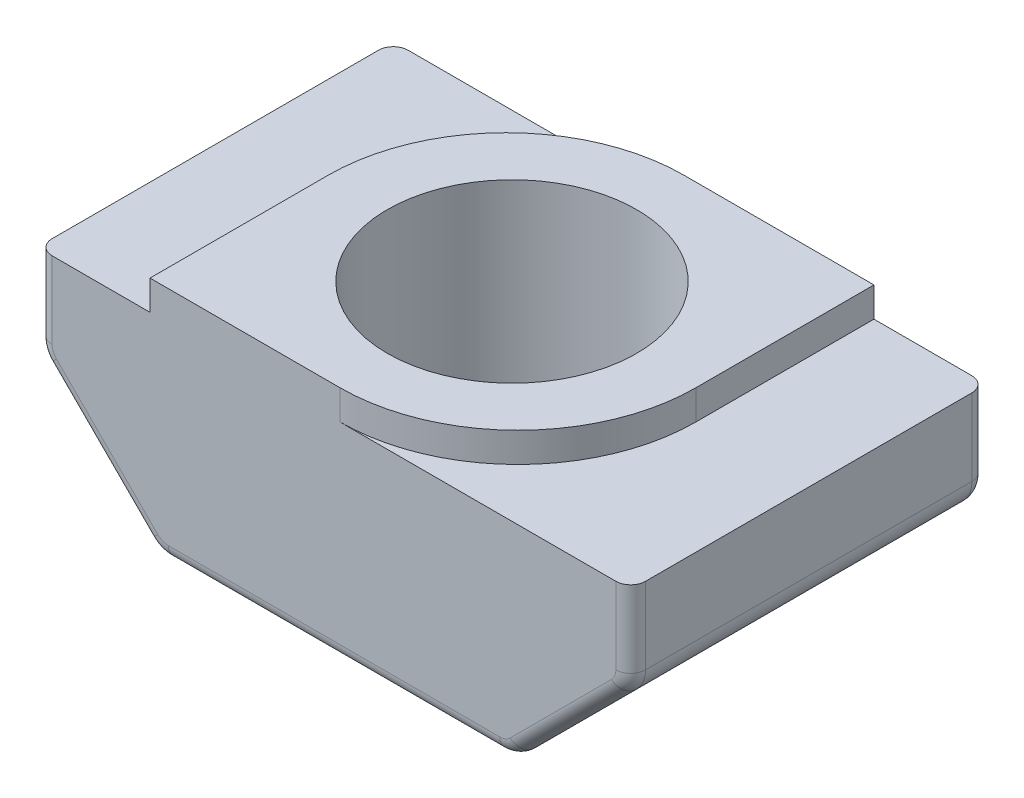
ISO-10303-21;
HEADER;
FILE_DESCRIPTION(('STEP AP214'),'2;1');
FILE_NAME('part.step','',(''),(''),'','','');
FILE_SCHEMA(('AUTOMOTIVE_DESIGN { 1 0 10303 214 1 1 1 1 }'));
ENDSEC;
DATA;
#1=APPLICATION_CONTEXT('core data for automotive mechanical design processes');
#2=APPLICATION_PROTOCOL_DEFINITION('international standard','automotive_design',2000,#1);
#3=PRODUCT_CONTEXT('',#1,'mechanical');
#4=PRODUCT('Part','Part','',(#3));
#5=PRODUCT_RELATED_PRODUCT_CATEGORY('part','',(#4));
#6=PRODUCT_DEFINITION_FORMATION('','',#4);
#7=PRODUCT_DEFINITION_CONTEXT('part definition',#1,'design');
#8=PRODUCT_DEFINITION('design','',#6,#7);
#9=PRODUCT_DEFINITION_SHAPE('','',#8);
#10=(LENGTH_UNIT() NAMED_UNIT(*) SI_UNIT(.MILLI.,.METRE.));
#11=(NAMED_UNIT(*) PLANE_ANGLE_UNIT() SI_UNIT($,.RADIAN.));
#12=(NAMED_UNIT(*) SI_UNIT($,.STERADIAN.) SOLID_ANGLE_UNIT());
#13=UNCERTAINTY_MEASURE_WITH_UNIT(LENGTH_MEASURE(1.E-05),#10,'distance_accuracy_value','');
#14=(GEOMETRIC_REPRESENTATION_CONTEXT(3) GLOBAL_UNCERTAINTY_ASSIGNED_CONTEXT((#13)) GLOBAL_UNIT_ASSIGNED_CONTEXT((#10,
#11,#12)) REPRESENTATION_CONTEXT('',''));
#15=CARTESIAN_POINT('',(0.,0.,0.));
#16=DIRECTION('',(0.,0.,1.));
#17=DIRECTION('',(1.,0.,0.));
#18=AXIS2_PLACEMENT_3D('',#15,#16,#17);
#19=CARTESIAN_POINT('',(-3.1,0.,6.));
#20=DIRECTION('',(1.,0.,0.));
#21=DIRECTION('',(0.,0.,-1.));
#22=AXIS2_PLACEMENT_3D('',#19,#20,#21);
#23=PLANE('',#22);
#24=DIRECTION('',(0.,0.,-1.));
#25=VECTOR('',#24,1.);
#26=CARTESIAN_POINT('',(-3.1,0.,6.));
#27=LINE('',#26,#25);
#28=CARTESIAN_POINT('',(-3.1,0.,6.));
#29=VERTEX_POINT('',#28);
#30=CARTESIAN_POINT('',(-3.1,0.,3.));
#31=VERTEX_POINT('',#30);
#32=EDGE_CURVE('E426',#29,#31,#27,.T.);
#33=ORIENTED_EDGE('',*,*,#32,.T.);
#34=DIRECTION('',(0.,-1.,0.));
#35=VECTOR('',#34,1.);
#36=CARTESIAN_POINT('',(-3.1,-0.500000000000001,3.));
#37=LINE('',#36,#35);
#38=CARTESIAN_POINT('',(-3.1,-0.500000000000001,3.));
#39=VERTEX_POINT('',#38);
#40=EDGE_CURVE('E238',#31,#39,#37,.T.);
#41=ORIENTED_EDGE('',*,*,#40,.T.);
#42=DIRECTION('',(0.,0.,-1.));
#43=VECTOR('',#42,1.);
#44=CARTESIAN_POINT('',(-3.1,-0.500000000000001,6.));
#45=LINE('',#44,#43);
#46=CARTESIAN_POINT('',(-3.1,-0.500000000000001,6.));
#47=VERTEX_POINT('',#46);
#48=EDGE_CURVE('E219',#47,#39,#45,.T.);
#49=ORIENTED_EDGE('',*,*,#48,.F.);
#50=DIRECTION('',(0.,-1.,0.));
#51=VECTOR('',#50,1.);
#52=CARTESIAN_POINT('',(-3.1,0.,6.));
#53=LINE('',#52,#51);
#54=EDGE_CURVE('E224',#29,#47,#53,.T.);
#55=ORIENTED_EDGE('',*,*,#54,.F.);
#56=EDGE_LOOP('',(#33,#41,#49,#55));
#57=FACE_BOUND('',#56,.T.);
#58=ADVANCED_FACE('F37',(#57),#23,.F.);
#59=CARTESIAN_POINT('',(-3.1,-0.500000000000001,6.));
#60=DIRECTION('',(0.,-1.,0.));
#61=DIRECTION('',(1.,0.,0.));
#62=AXIS2_PLACEMENT_3D('',#59,#60,#61);
#63=PLANE('',#62);
#64=DIRECTION('',(-1.,0.,0.));
#65=VECTOR('',#64,1.);
#66=CARTESIAN_POINT('',(-3.1,-0.500000000000001,0.));
#67=LINE('',#66,#65);
#68=CARTESIAN_POINT('',(-0.0999999999999998,-0.500000000000001,0.));
#69=VERTEX_POINT('',#68);
#70=CARTESIAN_POINT('',(-4.75,-0.500000000000001,0.));
#71=VERTEX_POINT('',#70);
#72=EDGE_CURVE('E429',#69,#71,#67,.T.);
#73=ORIENTED_EDGE('',*,*,#72,.T.);
#74=CARTESIAN_POINT('',(-4.75,-0.500000000000001,0.25));
#75=DIRECTION('',(0.,-1.,0.));
#76=DIRECTION('',(1.,0.,0.));
#77=AXIS2_PLACEMENT_3D('',#74,#75,#76);
#78=CIRCLE('',#77,0.25);
#79=CARTESIAN_POINT('',(-5.,-0.500000000000001,0.25));
#80=VERTEX_POINT('',#79);
#81=EDGE_CURVE('E310',#71,#80,#78,.F.);
#82=ORIENTED_EDGE('',*,*,#81,.T.);
#83=DIRECTION('',(0.,0.,-1.));
#84=VECTOR('',#83,1.);
#85=CARTESIAN_POINT('',(-5.,-0.500000000000001,6.));
#86=LINE('',#85,#84);
#87=CARTESIAN_POINT('',(-5.,-0.500000000000001,5.75));
#88=VERTEX_POINT('',#87);
#89=EDGE_CURVE('E239',#88,#80,#86,.T.);
#90=ORIENTED_EDGE('',*,*,#89,.F.);
#91=CARTESIAN_POINT('',(-4.75,-0.500000000000001,5.75));
#92=DIRECTION('',(0.,-1.,0.));
#93=DIRECTION('',(1.,0.,0.));
#94=AXIS2_PLACEMENT_3D('',#91,#92,#93);
#95=CIRCLE('',#94,0.25);
#96=CARTESIAN_POINT('',(-4.75,-0.500000000000001,6.));
#97=VERTEX_POINT('',#96);
#98=EDGE_CURVE('E222',#88,#97,#95,.F.);
#99=ORIENTED_EDGE('',*,*,#98,.T.);
#100=DIRECTION('',(-1.,0.,0.));
#101=VECTOR('',#100,1.);
#102=CARTESIAN_POINT('',(-3.1,-0.500000000000001,6.));
#103=LINE('',#102,#101);
#104=EDGE_CURVE('E213',#47,#97,#103,.T.);
#105=ORIENTED_EDGE('',*,*,#104,.F.);
#106=ORIENTED_EDGE('',*,*,#48,.T.);
#107=CARTESIAN_POINT('',(-0.0999999999999998,-0.500000000000001,3.));
#108=DIRECTION('',(0.,-1.,0.));
#109=DIRECTION('',(1.,0.,0.));
#110=AXIS2_PLACEMENT_3D('',#107,#108,#109);
#111=CIRCLE('',#110,3.);
#112=EDGE_CURVE('E257',#39,#69,#111,.T.);
#113=ORIENTED_EDGE('',*,*,#112,.T.);
#114=EDGE_LOOP('',(#73,#82,#90,#99,#105,#106,#113));
#115=FACE_BOUND('',#114,.T.);
#116=ADVANCED_FACE('F216',(#115),#63,.F.);
#117=CARTESIAN_POINT('',(-5.,-0.500000000000001,6.));
#118=DIRECTION('',(1.,0.,0.));
#119=DIRECTION('',(0.,0.,-1.));
#120=AXIS2_PLACEMENT_3D('',#117,#118,#119);
#121=PLANE('',#120);
#122=ORIENTED_EDGE('',*,*,#89,.T.);
#123=DIRECTION('',(0.,-1.,0.));
#124=VECTOR('',#123,1.);
#125=CARTESIAN_POINT('',(-5.,-1.79289321881345,0.25));
#126=LINE('',#125,#124);
#127=CARTESIAN_POINT('',(-5.,-1.79289321881345,0.25));
#128=VERTEX_POINT('',#127);
#129=EDGE_CURVE('E288',#80,#128,#126,.T.);
#130=ORIENTED_EDGE('',*,*,#129,.T.);
#131=DIRECTION('',(0.,0.,-1.));
#132=VECTOR('',#131,1.);
#133=CARTESIAN_POINT('',(-5.,-1.79289321881345,6.));
#134=LINE('',#133,#132);
#135=CARTESIAN_POINT('',(-5.,-1.79289321881345,5.75));
#136=VERTEX_POINT('',#135);
#137=EDGE_CURVE('E283',#128,#136,#134,.F.);
#138=ORIENTED_EDGE('',*,*,#137,.T.);
#139=DIRECTION('',(0.,-1.,0.));
#140=VECTOR('',#139,1.);
#141=CARTESIAN_POINT('',(-5.,-0.500000000000001,5.75));
#142=LINE('',#141,#140);
#143=EDGE_CURVE('E286',#136,#88,#142,.F.);
#144=ORIENTED_EDGE('',*,*,#143,.T.);
#145=EDGE_LOOP('',(#122,#130,#138,#144));
#146=FACE_BOUND('',#145,.T.);
#147=ADVANCED_FACE('F479',(#146),#121,.F.);
#148=CARTESIAN_POINT('',(-5.,-2.,6.));
#149=DIRECTION('',(0.707106781186546,0.707106781186549,0.));
#150=DIRECTION('',(-0.707106781186549,0.707106781186546,0.));
#151=AXIS2_PLACEMENT_3D('',#148,#149,#150);
#152=PLANE('',#151);
#153=DIRECTION('',(0.,0.,-1.));
#154=VECTOR('',#153,1.);
#155=CARTESIAN_POINT('',(-4.85355339059327,-2.14644660940673,6.));
#156=LINE('',#155,#154);
#157=CARTESIAN_POINT('',(-4.85355339059327,-2.14644660940673,5.75));
#158=VERTEX_POINT('',#157);
#159=CARTESIAN_POINT('',(-4.85355339059327,-2.14644660940673,0.25));
#160=VERTEX_POINT('',#159);
#161=EDGE_CURVE('E280',#158,#160,#156,.T.);
#162=ORIENTED_EDGE('',*,*,#161,.T.);
#163=DIRECTION('',(0.707106781186549,-0.707106781186546,0.));
#164=VECTOR('',#163,1.);
#165=CARTESIAN_POINT('',(-3.14644660940672,-3.85355339059328,0.25));
#166=LINE('',#165,#164);
#167=CARTESIAN_POINT('',(-3.14644660940672,-3.85355339059328,0.25));
#168=VERTEX_POINT('',#167);
#169=EDGE_CURVE('E318',#160,#168,#166,.T.);
#170=ORIENTED_EDGE('',*,*,#169,.T.);
#171=DIRECTION('',(0.,0.,-1.));
#172=VECTOR('',#171,1.);
#173=CARTESIAN_POINT('',(-3.14644660940672,-3.85355339059328,6.));
#174=LINE('',#173,#172);
#175=CARTESIAN_POINT('',(-3.14644660940672,-3.85355339059328,5.75));
#176=VERTEX_POINT('',#175);
#177=EDGE_CURVE('E277',#168,#176,#174,.F.);
#178=ORIENTED_EDGE('',*,*,#177,.T.);
#179=DIRECTION('',(0.707106781186549,-0.707106781186546,0.));
#180=VECTOR('',#179,1.);
#181=CARTESIAN_POINT('',(-5.,-2.,5.75));
#182=LINE('',#181,#180);
#183=EDGE_CURVE('E316',#176,#158,#182,.F.);
#184=ORIENTED_EDGE('',*,*,#183,.T.);
#185=EDGE_LOOP('',(#162,#170,#178,#184));
#186=FACE_BOUND('',#185,.T.);
#187=ADVANCED_FACE('F796',(#186),#152,.F.);
#188=CARTESIAN_POINT('',(-2.99999999999999,-4.,6.));
#189=DIRECTION('',(0.,1.,0.));
#190=DIRECTION('',(0.,0.,1.));
#191=AXIS2_PLACEMENT_3D('',#188,#189,#190);
#192=PLANE('',#191);
#193=CARTESIAN_POINT('',(0.,-4.,3.));
#194=DIRECTION('',(0.,1.,0.));
#195=DIRECTION('',(0.,0.,1.));
#196=AXIS2_PLACEMENT_3D('',#193,#194,#195);
#197=CIRCLE('',#196,2.1);
#198=CARTESIAN_POINT('',(0.,-4.,5.1));
#199=VERTEX_POINT('',#198);
#200=EDGE_CURVE('E432',#199,#199,#197,.T.);
#201=ORIENTED_EDGE('',*,*,#200,.T.);
#202=EDGE_LOOP('',(#201));
#203=FACE_BOUND('',#202,.T.);
#204=DIRECTION('',(0.,0.,-1.));
#205=VECTOR('',#204,1.);
#206=CARTESIAN_POINT('',(-2.79289321881344,-4.,6.));
#207=LINE('',#206,#205);
#208=CARTESIAN_POINT('',(-2.79289321881344,-4.,5.75));
#209=VERTEX_POINT('',#208);
#210=CARTESIAN_POINT('',(-2.79289321881344,-4.,0.25));
#211=VERTEX_POINT('',#210);
#212=EDGE_CURVE('E271',#209,#211,#207,.T.);
#213=ORIENTED_EDGE('',*,*,#212,.T.);
#214=DIRECTION('',(1.,0.,0.));
#215=VECTOR('',#214,1.);
#216=CARTESIAN_POINT('',(2.79289321881344,-4.,0.25));
#217=LINE('',#216,#215);
#218=CARTESIAN_POINT('',(2.79289321881344,-4.,0.25));
#219=VERTEX_POINT('',#218);
#220=EDGE_CURVE('E11',#211,#219,#217,.T.);
#221=ORIENTED_EDGE('',*,*,#220,.T.);
#222=DIRECTION('',(0.,0.,-1.));
#223=VECTOR('',#222,1.);
#224=CARTESIAN_POINT('',(2.79289321881344,-4.,6.));
#225=LINE('',#224,#223);
#226=CARTESIAN_POINT('',(2.79289321881344,-4.,5.75));
#227=VERTEX_POINT('',#226);
#228=EDGE_CURVE('E274',#219,#227,#225,.F.);
#229=ORIENTED_EDGE('',*,*,#228,.T.);
#230=DIRECTION('',(1.,0.,0.));
#231=VECTOR('',#230,1.);
#232=CARTESIAN_POINT('',(-2.99999999999999,-4.,5.75));
#233=LINE('',#232,#231);
#234=EDGE_CURVE('E46',#227,#209,#233,.F.);
#235=ORIENTED_EDGE('',*,*,#234,.T.);
#236=EDGE_LOOP('',(#213,#221,#229,#235));
#237=FACE_BOUND('',#236,.T.);
#238=ADVANCED_FACE('F787',(#203,#237),#192,.F.);
#239=CARTESIAN_POINT('',(5.,-2.,6.));
#240=DIRECTION('',(-0.707106781186546,0.707106781186549,0.));
#241=DIRECTION('',(-0.707106781186549,-0.707106781186546,0.));
#242=AXIS2_PLACEMENT_3D('',#239,#240,#241);
#243=PLANE('',#242);
#244=DIRECTION('',(0.,0.,-1.));
#245=VECTOR('',#244,1.);
#246=CARTESIAN_POINT('',(3.14644660940672,-3.85355339059328,6.));
#247=LINE('',#246,#245);
#248=CARTESIAN_POINT('',(3.14644660940672,-3.85355339059328,5.75));
#249=VERTEX_POINT('',#248);
#250=CARTESIAN_POINT('',(3.14644660940672,-3.85355339059328,0.25));
#251=VERTEX_POINT('',#250);
#252=EDGE_CURVE('E265',#249,#251,#247,.T.);
#253=ORIENTED_EDGE('',*,*,#252,.T.);
#254=DIRECTION('',(0.707106781186549,0.707106781186546,0.));
#255=VECTOR('',#254,1.);
#256=CARTESIAN_POINT('',(4.85355339059327,-2.14644660940673,0.25));
#257=LINE('',#256,#255);
#258=CARTESIAN_POINT('',(4.85355339059327,-2.14644660940673,0.25));
#259=VERTEX_POINT('',#258);
#260=EDGE_CURVE('E338',#251,#259,#257,.T.);
#261=ORIENTED_EDGE('',*,*,#260,.T.);
#262=DIRECTION('',(0.,0.,-1.));
#263=VECTOR('',#262,1.);
#264=CARTESIAN_POINT('',(4.85355339059327,-2.14644660940673,6.));
#265=LINE('',#264,#263);
#266=CARTESIAN_POINT('',(4.85355339059327,-2.14644660940673,5.75));
#267=VERTEX_POINT('',#266);
#268=EDGE_CURVE('E268',#259,#267,#265,.F.);
#269=ORIENTED_EDGE('',*,*,#268,.T.);
#270=DIRECTION('',(0.707106781186549,0.707106781186546,0.));
#271=VECTOR('',#270,1.);
#272=CARTESIAN_POINT('',(5.,-2.,5.75));
#273=LINE('',#272,#271);
#274=EDGE_CURVE('E336',#267,#249,#273,.F.);
#275=ORIENTED_EDGE('',*,*,#274,.T.);
#276=EDGE_LOOP('',(#253,#261,#269,#275));
#277=FACE_BOUND('',#276,.T.);
#278=ADVANCED_FACE('F779',(#277),#243,.F.);
#279=CARTESIAN_POINT('',(5.,-0.500000000000001,6.));
#280=DIRECTION('',(-1.,0.,0.));
#281=DIRECTION('',(0.,0.,1.));
#282=AXIS2_PLACEMENT_3D('',#279,#280,#281);
#283=PLANE('',#282);
#284=DIRECTION('',(0.,0.,-1.));
#285=VECTOR('',#284,1.);
#286=CARTESIAN_POINT('',(5.,-1.79289321881345,6.));
#287=LINE('',#286,#285);
#288=CARTESIAN_POINT('',(5.,-1.79289321881345,5.75));
#289=VERTEX_POINT('',#288);
#290=CARTESIAN_POINT('',(5.,-1.79289321881345,0.25));
#291=VERTEX_POINT('',#290);
#292=EDGE_CURVE('E262',#289,#291,#287,.T.);
#293=ORIENTED_EDGE('',*,*,#292,.T.);
#294=DIRECTION('',(0.,1.,0.));
#295=VECTOR('',#294,1.);
#296=CARTESIAN_POINT('',(5.,-0.500000000000001,0.25));
#297=LINE('',#296,#295);
#298=CARTESIAN_POINT('',(5.,-0.500000000000001,0.25));
#299=VERTEX_POINT('',#298);
#300=EDGE_CURVE('E326',#291,#299,#297,.T.);
#301=ORIENTED_EDGE('',*,*,#300,.T.);
#302=DIRECTION('',(0.,0.,-1.));
#303=VECTOR('',#302,1.);
#304=CARTESIAN_POINT('',(5.,-0.500000000000001,6.));
#305=LINE('',#304,#303);
#306=CARTESIAN_POINT('',(5.,-0.500000000000001,5.75));
#307=VERTEX_POINT('',#306);
#308=EDGE_CURVE('E244',#307,#299,#305,.T.);
#309=ORIENTED_EDGE('',*,*,#308,.F.);
#310=DIRECTION('',(0.,1.,0.));
#311=VECTOR('',#310,1.);
#312=CARTESIAN_POINT('',(5.,-0.500000000000001,5.75));
#313=LINE('',#312,#311);
#314=EDGE_CURVE('E324',#307,#289,#313,.F.);
#315=ORIENTED_EDGE('',*,*,#314,.T.);
#316=EDGE_LOOP('',(#293,#301,#309,#315));
#317=FACE_BOUND('',#316,.T.);
#318=ADVANCED_FACE('F771',(#317),#283,.F.);
#319=CARTESIAN_POINT('',(3.1,-0.500000000000001,6.));
#320=DIRECTION('',(0.,-1.,0.));
#321=DIRECTION('',(1.,0.,0.));
#322=AXIS2_PLACEMENT_3D('',#319,#320,#321);
#323=PLANE('',#322);
#324=ORIENTED_EDGE('',*,*,#308,.T.);
#325=CARTESIAN_POINT('',(4.75,-0.500000000000001,0.25));
#326=DIRECTION('',(0.,-1.,0.));
#327=DIRECTION('',(1.,0.,0.));
#328=AXIS2_PLACEMENT_3D('',#325,#326,#327);
#329=CIRCLE('',#328,0.25);
#330=CARTESIAN_POINT('',(4.75,-0.500000000000001,0.));
#331=VERTEX_POINT('',#330);
#332=EDGE_CURVE('E330',#299,#331,#329,.F.);
#333=ORIENTED_EDGE('',*,*,#332,.T.);
#334=DIRECTION('',(-1.,0.,0.));
#335=VECTOR('',#334,1.);
#336=CARTESIAN_POINT('',(3.1,-0.500000000000001,0.));
#337=LINE('',#336,#335);
#338=CARTESIAN_POINT('',(3.1,-0.500000000000001,0.));
#339=VERTEX_POINT('',#338);
#340=EDGE_CURVE('E431',#331,#339,#337,.T.);
#341=ORIENTED_EDGE('',*,*,#340,.T.);
#342=DIRECTION('',(0.,0.,-1.));
#343=VECTOR('',#342,1.);
#344=CARTESIAN_POINT('',(3.1,-0.500000000000001,6.));
#345=LINE('',#344,#343);
#346=CARTESIAN_POINT('',(3.1,-0.500000000000001,3.));
#347=VERTEX_POINT('',#346);
#348=EDGE_CURVE('E442',#347,#339,#345,.T.);
#349=ORIENTED_EDGE('',*,*,#348,.F.);
#350=CARTESIAN_POINT('',(0.0999999999999998,-0.500000000000001,3.));
#351=DIRECTION('',(0.,-1.,0.));
#352=DIRECTION('',(1.,0.,0.));
#353=AXIS2_PLACEMENT_3D('',#350,#351,#352);
#354=CIRCLE('',#353,3.);
#355=CARTESIAN_POINT('',(0.0999999999999998,-0.500000000000001,6.));
#356=VERTEX_POINT('',#355);
#357=EDGE_CURVE('E259',#347,#356,#354,.T.);
#358=ORIENTED_EDGE('',*,*,#357,.T.);
#359=DIRECTION('',(-1.,0.,0.));
#360=VECTOR('',#359,1.);
#361=CARTESIAN_POINT('',(3.1,-0.500000000000001,6.));
#362=LINE('',#361,#360);
#363=CARTESIAN_POINT('',(4.75,-0.500000000000001,6.));
#364=VERTEX_POINT('',#363);
#365=EDGE_CURVE('E223',#364,#356,#362,.T.);
#366=ORIENTED_EDGE('',*,*,#365,.F.);
#367=CARTESIAN_POINT('',(4.75,-0.500000000000001,5.75));
#368=DIRECTION('',(0.,-1.,0.));
#369=DIRECTION('',(1.,0.,0.));
#370=AXIS2_PLACEMENT_3D('',#367,#368,#369);
#371=CIRCLE('',#370,0.25);
#372=EDGE_CURVE('E328',#364,#307,#371,.F.);
#373=ORIENTED_EDGE('',*,*,#372,.T.);
#374=EDGE_LOOP('',(#324,#333,#341,#349,#358,#366,#373));
#375=FACE_BOUND('',#374,.T.);
#376=ADVANCED_FACE('F420',(#375),#323,.F.);
#377=CARTESIAN_POINT('',(3.1,0.,6.));
#378=DIRECTION('',(-1.,0.,0.));
#379=DIRECTION('',(0.,0.,1.));
#380=AXIS2_PLACEMENT_3D('',#377,#378,#379);
#381=PLANE('',#380);
#382=DIRECTION('',(0.,0.,-1.));
#383=VECTOR('',#382,1.);
#384=CARTESIAN_POINT('',(3.1,0.,6.));
#385=LINE('',#384,#383);
#386=CARTESIAN_POINT('',(3.1,0.,3.));
#387=VERTEX_POINT('',#386);
#388=CARTESIAN_POINT('',(3.1,0.,0.));
#389=VERTEX_POINT('',#388);
#390=EDGE_CURVE('E440',#387,#389,#385,.T.);
#391=ORIENTED_EDGE('',*,*,#390,.F.);
#392=DIRECTION('',(0.,1.,0.));
#393=VECTOR('',#392,1.);
#394=CARTESIAN_POINT('',(3.1,0.,3.));
#395=LINE('',#394,#393);
#396=EDGE_CURVE('E255',#387,#347,#395,.F.);
#397=ORIENTED_EDGE('',*,*,#396,.T.);
#398=ORIENTED_EDGE('',*,*,#348,.T.);
#399=DIRECTION('',(0.,1.,0.));
#400=VECTOR('',#399,1.);
#401=CARTESIAN_POINT('',(3.1,0.,0.));
#402=LINE('',#401,#400);
#403=EDGE_CURVE('E434',#339,#389,#402,.T.);
#404=ORIENTED_EDGE('',*,*,#403,.T.);
#405=EDGE_LOOP('',(#391,#397,#398,#404));
#406=FACE_BOUND('',#405,.T.);
#407=ADVANCED_FACE('F460',(#406),#381,.F.);
#408=CARTESIAN_POINT('',(3.1,0.,6.));
#409=DIRECTION('',(0.,-1.,0.));
#410=DIRECTION('',(1.,0.,0.));
#411=AXIS2_PLACEMENT_3D('',#408,#409,#410);
#412=PLANE('',#411);
#413=CARTESIAN_POINT('',(0.,0.,3.));
#414=DIRECTION('',(0.,1.,0.));
#415=DIRECTION('',(0.,0.,1.));
#416=AXIS2_PLACEMENT_3D('',#413,#414,#415);
#417=CIRCLE('',#416,2.1);
#418=CARTESIAN_POINT('',(0.,0.,5.1));
#419=VERTEX_POINT('',#418);
#420=EDGE_CURVE('E385',#419,#419,#417,.T.);
#421=ORIENTED_EDGE('',*,*,#420,.F.);
#422=EDGE_LOOP('',(#421));
#423=FACE_BOUND('',#422,.T.);
#424=DIRECTION('',(-1.,0.,0.));
#425=VECTOR('',#424,1.);
#426=CARTESIAN_POINT('',(3.1,0.,0.));
#427=LINE('',#426,#425);
#428=CARTESIAN_POINT('',(-0.099999999999999,0.,0.));
#429=VERTEX_POINT('',#428);
#430=EDGE_CURVE('E234',#389,#429,#427,.T.);
#431=ORIENTED_EDGE('',*,*,#430,.T.);
#432=CARTESIAN_POINT('',(-0.0999999999999998,0.,3.));
#433=DIRECTION('',(0.,-1.,0.));
#434=DIRECTION('',(1.,0.,0.));
#435=AXIS2_PLACEMENT_3D('',#432,#433,#434);
#436=CIRCLE('',#435,3.);
#437=EDGE_CURVE('E251',#429,#31,#436,.F.);
#438=ORIENTED_EDGE('',*,*,#437,.T.);
#439=ORIENTED_EDGE('',*,*,#32,.F.);
#440=DIRECTION('',(-1.,0.,0.));
#441=VECTOR('',#440,1.);
#442=CARTESIAN_POINT('',(3.1,0.,6.));
#443=LINE('',#442,#441);
#444=CARTESIAN_POINT('',(0.100000000000001,0.,6.));
#445=VERTEX_POINT('',#444);
#446=EDGE_CURVE('E230',#445,#29,#443,.T.);
#447=ORIENTED_EDGE('',*,*,#446,.F.);
#448=CARTESIAN_POINT('',(0.0999999999999998,0.,3.));
#449=DIRECTION('',(0.,-1.,0.));
#450=DIRECTION('',(1.,0.,0.));
#451=AXIS2_PLACEMENT_3D('',#448,#449,#450);
#452=CIRCLE('',#451,3.);
#453=EDGE_CURVE('E249',#445,#387,#452,.F.);
#454=ORIENTED_EDGE('',*,*,#453,.T.);
#455=ORIENTED_EDGE('',*,*,#390,.T.);
#456=EDGE_LOOP('',(#431,#438,#439,#447,#454,#455));
#457=FACE_BOUND('',#456,.T.);
#458=ADVANCED_FACE('F465',(#423,#457),#412,.F.);
#459=CARTESIAN_POINT('',(0.,0.,6.));
#460=DIRECTION('',(0.,0.,-1.));
#461=DIRECTION('',(-1.,0.,0.));
#462=AXIS2_PLACEMENT_3D('',#459,#460,#461);
#463=PLANE('',#462);
#464=ORIENTED_EDGE('',*,*,#104,.T.);
#465=DIRECTION('',(0.,-1.,0.));
#466=VECTOR('',#465,1.);
#467=CARTESIAN_POINT('',(-4.75,0.,6.));
#468=LINE('',#467,#466);
#469=CARTESIAN_POINT('',(-4.75,-1.79289321881345,6.));
#470=VERTEX_POINT('',#469);
#471=EDGE_CURVE('E359',#97,#470,#468,.T.);
#472=ORIENTED_EDGE('',*,*,#471,.T.);
#473=CARTESIAN_POINT('',(-4.5,-1.79289321881345,6.));
#474=DIRECTION('',(0.,0.,-1.));
#475=DIRECTION('',(-1.,0.,0.));
#476=AXIS2_PLACEMENT_3D('',#473,#474,#475);
#477=CIRCLE('',#476,0.25);
#478=CARTESIAN_POINT('',(-4.67677669529664,-1.96966991411009,6.));
#479=VERTEX_POINT('',#478);
#480=EDGE_CURVE('E61',#470,#479,#477,.F.);
#481=ORIENTED_EDGE('',*,*,#480,.T.);
#482=DIRECTION('',(0.707106781186549,-0.707106781186546,0.));
#483=VECTOR('',#482,1.);
#484=CARTESIAN_POINT('',(-3.32322330470335,-3.32322330470337,6.));
#485=LINE('',#484,#483);
#486=CARTESIAN_POINT('',(-2.96966991411008,-3.67677669529664,6.));
#487=VERTEX_POINT('',#486);
#488=EDGE_CURVE('E356',#479,#487,#485,.T.);
#489=ORIENTED_EDGE('',*,*,#488,.T.);
#490=CARTESIAN_POINT('',(-2.79289321881344,-3.5,6.));
#491=DIRECTION('',(0.,0.,-1.));
#492=DIRECTION('',(-1.,0.,0.));
#493=AXIS2_PLACEMENT_3D('',#490,#491,#492);
#494=CIRCLE('',#493,0.25);
#495=CARTESIAN_POINT('',(-2.79289321881344,-3.75,6.));
#496=VERTEX_POINT('',#495);
#497=EDGE_CURVE('E354',#487,#496,#494,.F.);
#498=ORIENTED_EDGE('',*,*,#497,.T.);
#499=DIRECTION('',(1.,0.,0.));
#500=VECTOR('',#499,1.);
#501=CARTESIAN_POINT('',(0.,-3.75,6.));
#502=LINE('',#501,#500);
#503=CARTESIAN_POINT('',(2.79289321881344,-3.75,6.));
#504=VERTEX_POINT('',#503);
#505=EDGE_CURVE('E344',#496,#504,#502,.T.);
#506=ORIENTED_EDGE('',*,*,#505,.T.);
#507=CARTESIAN_POINT('',(2.79289321881344,-3.5,6.));
#508=DIRECTION('',(0.,0.,-1.));
#509=DIRECTION('',(-1.,0.,0.));
#510=AXIS2_PLACEMENT_3D('',#507,#508,#509);
#511=CIRCLE('',#510,0.25);
#512=CARTESIAN_POINT('',(2.96966991411008,-3.67677669529664,6.));
#513=VERTEX_POINT('',#512);
#514=EDGE_CURVE('E346',#504,#513,#511,.F.);
#515=ORIENTED_EDGE('',*,*,#514,.T.);
#516=DIRECTION('',(0.707106781186549,0.707106781186546,0.));
#517=VECTOR('',#516,1.);
#518=CARTESIAN_POINT('',(3.32322330470335,-3.32322330470337,6.));
#519=LINE('',#518,#517);
#520=CARTESIAN_POINT('',(4.67677669529664,-1.96966991411009,6.));
#521=VERTEX_POINT('',#520);
#522=EDGE_CURVE('E348',#513,#521,#519,.T.);
#523=ORIENTED_EDGE('',*,*,#522,.T.);
#524=CARTESIAN_POINT('',(4.5,-1.79289321881345,6.));
#525=DIRECTION('',(0.,0.,-1.));
#526=DIRECTION('',(-1.,0.,0.));
#527=AXIS2_PLACEMENT_3D('',#524,#525,#526);
#528=CIRCLE('',#527,0.25);
#529=CARTESIAN_POINT('',(4.75,-1.79289321881345,6.));
#530=VERTEX_POINT('',#529);
#531=EDGE_CURVE('E350',#521,#530,#528,.F.);
#532=ORIENTED_EDGE('',*,*,#531,.T.);
#533=DIRECTION('',(0.,1.,0.));
#534=VECTOR('',#533,1.);
#535=CARTESIAN_POINT('',(4.75,0.,6.));
#536=LINE('',#535,#534);
#537=EDGE_CURVE('E352',#530,#364,#536,.T.);
#538=ORIENTED_EDGE('',*,*,#537,.T.);
#539=ORIENTED_EDGE('',*,*,#365,.T.);
#540=DIRECTION('',(0.,1.,0.));
#541=VECTOR('',#540,1.);
#542=CARTESIAN_POINT('',(0.0999999999999998,0.,6.));
#543=LINE('',#542,#541);
#544=EDGE_CURVE('E253',#356,#445,#543,.T.);
#545=ORIENTED_EDGE('',*,*,#544,.T.);
#546=ORIENTED_EDGE('',*,*,#446,.T.);
#547=ORIENTED_EDGE('',*,*,#54,.T.);
#548=EDGE_LOOP('',(#464,#472,#481,#489,#498,#506,#515,#523,#532,#538,#539,#545,#546,#547));
#549=FACE_BOUND('',#548,.T.);
#550=ADVANCED_FACE('F227',(#549),#463,.F.);
#551=CARTESIAN_POINT('',(0.,0.,0.));
#552=DIRECTION('',(0.,0.,-1.));
#553=DIRECTION('',(-1.,0.,0.));
#554=AXIS2_PLACEMENT_3D('',#551,#552,#553);
#555=PLANE('',#554);
#556=CARTESIAN_POINT('',(-4.5,-1.79289321881345,0.));
#557=DIRECTION('',(0.,0.,-1.));
#558=DIRECTION('',(-1.,0.,0.));
#559=AXIS2_PLACEMENT_3D('',#556,#557,#558);
#560=CIRCLE('',#559,0.25);
#561=CARTESIAN_POINT('',(-4.67677669529664,-1.96966991411009,0.));
#562=VERTEX_POINT('',#561);
#563=CARTESIAN_POINT('',(-4.75,-1.79289321881345,0.));
#564=VERTEX_POINT('',#563);
#565=EDGE_CURVE('E305',#562,#564,#560,.T.);
#566=ORIENTED_EDGE('',*,*,#565,.T.);
#567=DIRECTION('',(0.,-1.,0.));
#568=VECTOR('',#567,1.);
#569=CARTESIAN_POINT('',(-4.75,-0.500000000000001,0.));
#570=LINE('',#569,#568);
#571=EDGE_CURVE('E307',#564,#71,#570,.F.);
#572=ORIENTED_EDGE('',*,*,#571,.T.);
#573=ORIENTED_EDGE('',*,*,#72,.F.);
#574=DIRECTION('',(0.,-1.,0.));
#575=VECTOR('',#574,1.);
#576=CARTESIAN_POINT('',(-0.0999999999999998,0.,0.));
#577=LINE('',#576,#575);
#578=EDGE_CURVE('E241',#69,#429,#577,.F.);
#579=ORIENTED_EDGE('',*,*,#578,.T.);
#580=ORIENTED_EDGE('',*,*,#430,.F.);
#581=ORIENTED_EDGE('',*,*,#403,.F.);
#582=ORIENTED_EDGE('',*,*,#340,.F.);
#583=DIRECTION('',(0.,1.,0.));
#584=VECTOR('',#583,1.);
#585=CARTESIAN_POINT('',(4.75,-1.79289321881345,0.));
#586=LINE('',#585,#584);
#587=CARTESIAN_POINT('',(4.75,-1.79289321881345,0.));
#588=VERTEX_POINT('',#587);
#589=EDGE_CURVE('E299',#331,#588,#586,.F.);
#590=ORIENTED_EDGE('',*,*,#589,.T.);
#591=CARTESIAN_POINT('',(4.5,-1.79289321881345,0.));
#592=DIRECTION('',(0.,0.,-1.));
#593=DIRECTION('',(-1.,0.,0.));
#594=AXIS2_PLACEMENT_3D('',#591,#592,#593);
#595=CIRCLE('',#594,0.25);
#596=CARTESIAN_POINT('',(4.67677669529664,-1.96966991411009,0.));
#597=VERTEX_POINT('',#596);
#598=EDGE_CURVE('E297',#588,#597,#595,.T.);
#599=ORIENTED_EDGE('',*,*,#598,.T.);
#600=DIRECTION('',(0.707106781186549,0.707106781186546,0.));
#601=VECTOR('',#600,1.);
#602=CARTESIAN_POINT('',(2.96966991411008,-3.67677669529664,0.));
#603=LINE('',#602,#601);
#604=CARTESIAN_POINT('',(2.96966991411008,-3.67677669529664,0.));
#605=VERTEX_POINT('',#604);
#606=EDGE_CURVE('E295',#597,#605,#603,.F.);
#607=ORIENTED_EDGE('',*,*,#606,.T.);
#608=CARTESIAN_POINT('',(2.79289321881344,-3.5,0.));
#609=DIRECTION('',(0.,0.,-1.));
#610=DIRECTION('',(-1.,0.,0.));
#611=AXIS2_PLACEMENT_3D('',#608,#609,#610);
#612=CIRCLE('',#611,0.25);
#613=CARTESIAN_POINT('',(2.79289321881344,-3.75,0.));
#614=VERTEX_POINT('',#613);
#615=EDGE_CURVE('E293',#605,#614,#612,.T.);
#616=ORIENTED_EDGE('',*,*,#615,.T.);
#617=DIRECTION('',(1.,0.,0.));
#618=VECTOR('',#617,1.);
#619=CARTESIAN_POINT('',(-2.79289321881344,-3.75,0.));
#620=LINE('',#619,#618);
#621=CARTESIAN_POINT('',(-2.79289321881344,-3.75,0.));
#622=VERTEX_POINT('',#621);
#623=EDGE_CURVE('E291',#614,#622,#620,.F.);
#624=ORIENTED_EDGE('',*,*,#623,.T.);
#625=CARTESIAN_POINT('',(-2.79289321881344,-3.5,0.));
#626=DIRECTION('',(0.,0.,-1.));
#627=DIRECTION('',(-1.,0.,0.));
#628=AXIS2_PLACEMENT_3D('',#625,#626,#627);
#629=CIRCLE('',#628,0.25);
#630=CARTESIAN_POINT('',(-2.96966991411008,-3.67677669529664,0.));
#631=VERTEX_POINT('',#630);
#632=EDGE_CURVE('E301',#622,#631,#629,.T.);
#633=ORIENTED_EDGE('',*,*,#632,.T.);
#634=DIRECTION('',(0.707106781186549,-0.707106781186546,0.));
#635=VECTOR('',#634,1.);
#636=CARTESIAN_POINT('',(-4.67677669529664,-1.96966991411009,0.));
#637=LINE('',#636,#635);
#638=EDGE_CURVE('E303',#631,#562,#637,.F.);
#639=ORIENTED_EDGE('',*,*,#638,.T.);
#640=EDGE_LOOP('',(#566,#572,#573,#579,#580,#581,#582,#590,#599,#607,#616,#624,#633,#639));
#641=FACE_BOUND('',#640,.T.);
#642=ADVANCED_FACE('F454',(#641),#555,.T.);
#643=CARTESIAN_POINT('',(0.,0.,3.));
#644=DIRECTION('',(0.,1.,0.));
#645=DIRECTION('',(0.,0.,1.));
#646=AXIS2_PLACEMENT_3D('',#643,#644,#645);
#647=CYLINDRICAL_SURFACE('',#646,2.1);
#648=ORIENTED_EDGE('',*,*,#200,.F.);
#649=EDGE_LOOP('',(#648));
#650=FACE_BOUND('',#649,.T.);
#651=ORIENTED_EDGE('',*,*,#420,.T.);
#652=EDGE_LOOP('',(#651));
#653=FACE_BOUND('',#652,.T.);
#654=ADVANCED_FACE('F506',(#650,#653),#647,.F.);
#655=CARTESIAN_POINT('',(-0.0999999999999998,0.,3.));
#656=DIRECTION('',(0.,1.,0.));
#657=DIRECTION('',(0.,0.,1.));
#658=AXIS2_PLACEMENT_3D('',#655,#656,#657);
#659=CYLINDRICAL_SURFACE('',#658,3.);
#660=ORIENTED_EDGE('',*,*,#437,.F.);
#661=ORIENTED_EDGE('',*,*,#578,.F.);
#662=ORIENTED_EDGE('',*,*,#112,.F.);
#663=ORIENTED_EDGE('',*,*,#40,.F.);
#664=EDGE_LOOP('',(#660,#661,#662,#663));
#665=FACE_BOUND('',#664,.T.);
#666=ADVANCED_FACE('F468',(#665),#659,.T.);
#667=CARTESIAN_POINT('',(0.0999999999999998,0.,3.));
#668=DIRECTION('',(0.,1.,0.));
#669=DIRECTION('',(0.,0.,1.));
#670=AXIS2_PLACEMENT_3D('',#667,#668,#669);
#671=CYLINDRICAL_SURFACE('',#670,3.);
#672=ORIENTED_EDGE('',*,*,#357,.F.);
#673=ORIENTED_EDGE('',*,*,#396,.F.);
#674=ORIENTED_EDGE('',*,*,#453,.F.);
#675=ORIENTED_EDGE('',*,*,#544,.F.);
#676=EDGE_LOOP('',(#672,#673,#674,#675));
#677=FACE_BOUND('',#676,.T.);
#678=ADVANCED_FACE('F463',(#677),#671,.T.);
#679=CARTESIAN_POINT('',(4.5,-1.79289321881345,6.));
#680=DIRECTION('',(0.,0.,-1.));
#681=DIRECTION('',(-1.,0.,0.));
#682=AXIS2_PLACEMENT_3D('',#679,#680,#681);
#683=CYLINDRICAL_SURFACE('',#682,0.5);
#684=ORIENTED_EDGE('',*,*,#268,.F.);
#685=CARTESIAN_POINT('',(4.5,-1.79289321881345,0.25));
#686=DIRECTION('',(0.,0.,-1.));
#687=DIRECTION('',(-1.,0.,0.));
#688=AXIS2_PLACEMENT_3D('',#685,#686,#687);
#689=CIRCLE('',#688,0.5);
#690=EDGE_CURVE('E334',#259,#291,#689,.F.);
#691=ORIENTED_EDGE('',*,*,#690,.T.);
#692=ORIENTED_EDGE('',*,*,#292,.F.);
#693=CARTESIAN_POINT('',(4.5,-1.79289321881345,5.75));
#694=DIRECTION('',(0.,0.,-1.));
#695=DIRECTION('',(-1.,0.,0.));
#696=AXIS2_PLACEMENT_3D('',#693,#694,#695);
#697=CIRCLE('',#696,0.5);
#698=EDGE_CURVE('E332',#289,#267,#697,.T.);
#699=ORIENTED_EDGE('',*,*,#698,.T.);
#700=EDGE_LOOP('',(#684,#691,#692,#699));
#701=FACE_BOUND('',#700,.T.);
#702=ADVANCED_FACE('F509',(#701),#683,.T.);
#703=CARTESIAN_POINT('',(2.79289321881344,-3.5,6.));
#704=DIRECTION('',(0.,0.,-1.));
#705=DIRECTION('',(-1.,0.,0.));
#706=AXIS2_PLACEMENT_3D('',#703,#704,#705);
#707=CYLINDRICAL_SURFACE('',#706,0.5);
#708=ORIENTED_EDGE('',*,*,#228,.F.);
#709=CARTESIAN_POINT('',(2.79289321881344,-3.5,0.25));
#710=DIRECTION('',(0.,0.,-1.));
#711=DIRECTION('',(-1.,0.,0.));
#712=AXIS2_PLACEMENT_3D('',#709,#710,#711);
#713=CIRCLE('',#712,0.5);
#714=EDGE_CURVE('E342',#219,#251,#713,.F.);
#715=ORIENTED_EDGE('',*,*,#714,.T.);
#716=ORIENTED_EDGE('',*,*,#252,.F.);
#717=CARTESIAN_POINT('',(2.79289321881344,-3.5,5.75));
#718=DIRECTION('',(0.,0.,-1.));
#719=DIRECTION('',(-1.,0.,0.));
#720=AXIS2_PLACEMENT_3D('',#717,#718,#719);
#721=CIRCLE('',#720,0.5);
#722=EDGE_CURVE('E340',#249,#227,#721,.T.);
#723=ORIENTED_EDGE('',*,*,#722,.T.);
#724=EDGE_LOOP('',(#708,#715,#716,#723));
#725=FACE_BOUND('',#724,.T.);
#726=ADVANCED_FACE('F512',(#725),#707,.T.);
#727=CARTESIAN_POINT('',(-4.5,-1.79289321881345,6.));
#728=DIRECTION('',(0.,0.,-1.));
#729=DIRECTION('',(-1.,0.,0.));
#730=AXIS2_PLACEMENT_3D('',#727,#728,#729);
#731=CYLINDRICAL_SURFACE('',#730,0.5);
#732=ORIENTED_EDGE('',*,*,#137,.F.);
#733=CARTESIAN_POINT('',(-4.5,-1.79289321881345,0.25));
#734=DIRECTION('',(0.,0.,-1.));
#735=DIRECTION('',(-1.,0.,0.));
#736=AXIS2_PLACEMENT_3D('',#733,#734,#735);
#737=CIRCLE('',#736,0.5);
#738=EDGE_CURVE('E314',#128,#160,#737,.F.);
#739=ORIENTED_EDGE('',*,*,#738,.T.);
#740=ORIENTED_EDGE('',*,*,#161,.F.);
#741=CARTESIAN_POINT('',(-4.5,-1.79289321881345,5.75));
#742=DIRECTION('',(0.,0.,-1.));
#743=DIRECTION('',(-1.,0.,0.));
#744=AXIS2_PLACEMENT_3D('',#741,#742,#743);
#745=CIRCLE('',#744,0.5);
#746=EDGE_CURVE('E312',#158,#136,#745,.T.);
#747=ORIENTED_EDGE('',*,*,#746,.T.);
#748=EDGE_LOOP('',(#732,#739,#740,#747));
#749=FACE_BOUND('',#748,.T.);
#750=ADVANCED_FACE('F481',(#749),#731,.T.);
#751=CARTESIAN_POINT('',(-2.79289321881344,-3.5,6.));
#752=DIRECTION('',(0.,0.,-1.));
#753=DIRECTION('',(-1.,0.,0.));
#754=AXIS2_PLACEMENT_3D('',#751,#752,#753);
#755=CYLINDRICAL_SURFACE('',#754,0.5);
#756=ORIENTED_EDGE('',*,*,#177,.F.);
#757=CARTESIAN_POINT('',(-2.79289321881344,-3.5,0.25));
#758=DIRECTION('',(0.,0.,-1.));
#759=DIRECTION('',(-1.,0.,0.));
#760=AXIS2_PLACEMENT_3D('',#757,#758,#759);
#761=CIRCLE('',#760,0.5);
#762=EDGE_CURVE('E322',#168,#211,#761,.F.);
#763=ORIENTED_EDGE('',*,*,#762,.T.);
#764=ORIENTED_EDGE('',*,*,#212,.F.);
#765=CARTESIAN_POINT('',(-2.79289321881344,-3.5,5.75));
#766=DIRECTION('',(0.,0.,-1.));
#767=DIRECTION('',(-1.,0.,0.));
#768=AXIS2_PLACEMENT_3D('',#765,#766,#767);
#769=CIRCLE('',#768,0.5);
#770=EDGE_CURVE('E320',#209,#176,#769,.T.);
#771=ORIENTED_EDGE('',*,*,#770,.T.);
#772=EDGE_LOOP('',(#756,#763,#764,#771));
#773=FACE_BOUND('',#772,.T.);
#774=ADVANCED_FACE('F519',(#773),#755,.T.);
#775=CARTESIAN_POINT('',(4.75,-0.500000000000001,0.25));
#776=DIRECTION('',(0.,-1.,0.));
#777=DIRECTION('',(0.,0.,-1.));
#778=AXIS2_PLACEMENT_3D('',#775,#776,#777);
#779=CYLINDRICAL_SURFACE('',#778,0.25);
#780=ORIENTED_EDGE('',*,*,#332,.F.);
#781=ORIENTED_EDGE('',*,*,#300,.F.);
#782=CARTESIAN_POINT('',(4.75,-1.79289321881345,0.25));
#783=DIRECTION('',(0.,-1.,0.));
#784=DIRECTION('',(0.,0.,-1.));
#785=AXIS2_PLACEMENT_3D('',#782,#783,#784);
#786=CIRCLE('',#785,0.25);
#787=EDGE_CURVE('E382',#588,#291,#786,.T.);
#788=ORIENTED_EDGE('',*,*,#787,.F.);
#789=ORIENTED_EDGE('',*,*,#589,.F.);
#790=EDGE_LOOP('',(#780,#781,#788,#789));
#791=FACE_BOUND('',#790,.T.);
#792=ADVANCED_FACE('F450',(#791),#779,.T.);
#793=CARTESIAN_POINT('',(4.5,-1.79289321881345,0.25));
#794=DIRECTION('',(0.,0.,-1.));
#795=DIRECTION('',(-1.,0.,0.));
#796=AXIS2_PLACEMENT_3D('',#793,#794,#795);
#797=DEGENERATE_TOROIDAL_SURFACE('',#796,0.25,0.25,.T.);
#798=ORIENTED_EDGE('',*,*,#787,.T.);
#799=ORIENTED_EDGE('',*,*,#690,.F.);
#800=CARTESIAN_POINT('',(4.67677669529664,-1.96966991411009,0.25));
#801=DIRECTION('',(-0.707106781186548,-0.707106781186548,0.));
#802=DIRECTION('',(0.707106781186548,-0.707106781186548,0.));
#803=AXIS2_PLACEMENT_3D('',#800,#801,#802);
#804=CIRCLE('',#803,0.25);
#805=EDGE_CURVE('E379',#597,#259,#804,.T.);
#806=ORIENTED_EDGE('',*,*,#805,.F.);
#807=ORIENTED_EDGE('',*,*,#598,.F.);
#808=EDGE_LOOP('',(#798,#799,#806,#807));
#809=FACE_BOUND('',#808,.T.);
#810=ADVANCED_FACE('F548',(#809),#797,.T.);
#811=CARTESIAN_POINT('',(4.82322330470336,-1.82322330470336,0.25));
#812=DIRECTION('',(-0.707106781186549,-0.707106781186546,0.));
#813=DIRECTION('',(0.707106781186546,-0.707106781186549,0.));
#814=AXIS2_PLACEMENT_3D('',#811,#812,#813);
#815=CYLINDRICAL_SURFACE('',#814,0.25);
#816=ORIENTED_EDGE('',*,*,#805,.T.);
#817=ORIENTED_EDGE('',*,*,#260,.F.);
#818=CARTESIAN_POINT('',(2.96966991411008,-3.67677669529664,0.25));
#819=DIRECTION('',(-0.707106781186548,-0.707106781186547,0.));
#820=DIRECTION('',(0.707106781186547,-0.707106781186548,0.));
#821=AXIS2_PLACEMENT_3D('',#818,#819,#820);
#822=CIRCLE('',#821,0.25);
#823=EDGE_CURVE('E376',#605,#251,#822,.T.);
#824=ORIENTED_EDGE('',*,*,#823,.F.);
#825=ORIENTED_EDGE('',*,*,#606,.F.);
#826=EDGE_LOOP('',(#816,#817,#824,#825));
#827=FACE_BOUND('',#826,.T.);
#828=ADVANCED_FACE('F544',(#827),#815,.T.);
#829=CARTESIAN_POINT('',(2.79289321881344,-3.5,0.25));
#830=DIRECTION('',(0.,0.,-1.));
#831=DIRECTION('',(-1.,0.,0.));
#832=AXIS2_PLACEMENT_3D('',#829,#830,#831);
#833=DEGENERATE_TOROIDAL_SURFACE('',#832,0.25,0.25,.T.);
#834=ORIENTED_EDGE('',*,*,#823,.T.);
#835=ORIENTED_EDGE('',*,*,#714,.F.);
#836=CARTESIAN_POINT('',(2.79289321881344,-3.75,0.25));
#837=DIRECTION('',(-1.,0.,0.));
#838=DIRECTION('',(0.,0.,1.));
#839=AXIS2_PLACEMENT_3D('',#836,#837,#838);
#840=CIRCLE('',#839,0.25);
#841=EDGE_CURVE('E373',#614,#219,#840,.T.);
#842=ORIENTED_EDGE('',*,*,#841,.F.);
#843=ORIENTED_EDGE('',*,*,#615,.F.);
#844=EDGE_LOOP('',(#834,#835,#842,#843));
#845=FACE_BOUND('',#844,.T.);
#846=ADVANCED_FACE('F540',(#845),#833,.T.);
#847=CARTESIAN_POINT('',(-2.99999999999999,-3.75,0.25));
#848=DIRECTION('',(-1.,0.,0.));
#849=DIRECTION('',(0.,0.,1.));
#850=AXIS2_PLACEMENT_3D('',#847,#848,#849);
#851=CYLINDRICAL_SURFACE('',#850,0.25);
#852=ORIENTED_EDGE('',*,*,#841,.T.);
#853=ORIENTED_EDGE('',*,*,#220,.F.);
#854=CARTESIAN_POINT('',(-2.79289321881344,-3.75,0.25));
#855=DIRECTION('',(-1.,0.,0.));
#856=DIRECTION('',(0.,0.,1.));
#857=AXIS2_PLACEMENT_3D('',#854,#855,#856);
#858=CIRCLE('',#857,0.25);
#859=EDGE_CURVE('E370',#622,#211,#858,.T.);
#860=ORIENTED_EDGE('',*,*,#859,.F.);
#861=ORIENTED_EDGE('',*,*,#623,.F.);
#862=EDGE_LOOP('',(#852,#853,#860,#861));
#863=FACE_BOUND('',#862,.T.);
#864=ADVANCED_FACE('F536',(#863),#851,.T.);
#865=CARTESIAN_POINT('',(-2.79289321881344,-3.5,0.25));
#866=DIRECTION('',(0.,0.,-1.));
#867=DIRECTION('',(-1.,0.,0.));
#868=AXIS2_PLACEMENT_3D('',#865,#866,#867);
#869=DEGENERATE_TOROIDAL_SURFACE('',#868,0.25,0.25,.T.);
#870=ORIENTED_EDGE('',*,*,#859,.T.);
#871=ORIENTED_EDGE('',*,*,#762,.F.);
#872=CARTESIAN_POINT('',(-2.96966991411008,-3.67677669529664,0.25));
#873=DIRECTION('',(-0.707106781186548,0.707106781186547,0.));
#874=DIRECTION('',(-0.707106781186547,-0.707106781186548,0.));
#875=AXIS2_PLACEMENT_3D('',#872,#873,#874);
#876=CIRCLE('',#875,0.25);
#877=EDGE_CURVE('E367',#631,#168,#876,.T.);
#878=ORIENTED_EDGE('',*,*,#877,.F.);
#879=ORIENTED_EDGE('',*,*,#632,.F.);
#880=EDGE_LOOP('',(#870,#871,#878,#879));
#881=FACE_BOUND('',#880,.T.);
#882=ADVANCED_FACE('F532',(#881),#869,.T.);
#883=CARTESIAN_POINT('',(-4.82322330470336,-1.82322330470336,0.25));
#884=DIRECTION('',(-0.707106781186549,0.707106781186546,0.));
#885=DIRECTION('',(-0.707106781186546,-0.707106781186549,0.));
#886=AXIS2_PLACEMENT_3D('',#883,#884,#885);
#887=CYLINDRICAL_SURFACE('',#886,0.25);
#888=ORIENTED_EDGE('',*,*,#877,.T.);
#889=ORIENTED_EDGE('',*,*,#169,.F.);
#890=CARTESIAN_POINT('',(-4.67677669529664,-1.96966991411009,0.25));
#891=DIRECTION('',(-0.707106781186548,0.707106781186548,0.));
#892=DIRECTION('',(-0.707106781186548,-0.707106781186548,0.));
#893=AXIS2_PLACEMENT_3D('',#890,#891,#892);
#894=CIRCLE('',#893,0.25);
#895=EDGE_CURVE('E364',#562,#160,#894,.T.);
#896=ORIENTED_EDGE('',*,*,#895,.F.);
#897=ORIENTED_EDGE('',*,*,#638,.F.);
#898=EDGE_LOOP('',(#888,#889,#896,#897));
#899=FACE_BOUND('',#898,.T.);
#900=ADVANCED_FACE('F528',(#899),#887,.T.);
#901=CARTESIAN_POINT('',(-4.5,-1.79289321881345,0.25));
#902=DIRECTION('',(0.,0.,-1.));
#903=DIRECTION('',(-1.,0.,0.));
#904=AXIS2_PLACEMENT_3D('',#901,#902,#903);
#905=DEGENERATE_TOROIDAL_SURFACE('',#904,0.25,0.25,.T.);
#906=ORIENTED_EDGE('',*,*,#895,.T.);
#907=ORIENTED_EDGE('',*,*,#738,.F.);
#908=CARTESIAN_POINT('',(-4.75,-1.79289321881345,0.25));
#909=DIRECTION('',(0.,1.,0.));
#910=DIRECTION('',(0.,0.,1.));
#911=AXIS2_PLACEMENT_3D('',#908,#909,#910);
#912=CIRCLE('',#911,0.25);
#913=EDGE_CURVE('E362',#564,#128,#912,.T.);
#914=ORIENTED_EDGE('',*,*,#913,.F.);
#915=ORIENTED_EDGE('',*,*,#565,.F.);
#916=EDGE_LOOP('',(#906,#907,#914,#915));
#917=FACE_BOUND('',#916,.T.);
#918=ADVANCED_FACE('F525',(#917),#905,.T.);
#919=CARTESIAN_POINT('',(-4.75,-0.500000000000001,0.25));
#920=DIRECTION('',(0.,1.,0.));
#921=DIRECTION('',(0.,0.,1.));
#922=AXIS2_PLACEMENT_3D('',#919,#920,#921);
#923=CYLINDRICAL_SURFACE('',#922,0.25);
#924=ORIENTED_EDGE('',*,*,#81,.F.);
#925=ORIENTED_EDGE('',*,*,#571,.F.);
#926=ORIENTED_EDGE('',*,*,#913,.T.);
#927=ORIENTED_EDGE('',*,*,#129,.F.);
#928=EDGE_LOOP('',(#924,#925,#926,#927));
#929=FACE_BOUND('',#928,.T.);
#930=ADVANCED_FACE('F474',(#929),#923,.T.);
#931=CARTESIAN_POINT('',(4.75,0.,5.75));
#932=DIRECTION('',(0.,1.,0.));
#933=DIRECTION('',(0.,0.,1.));
#934=AXIS2_PLACEMENT_3D('',#931,#932,#933);
#935=CYLINDRICAL_SURFACE('',#934,0.25);
#936=ORIENTED_EDGE('',*,*,#372,.F.);
#937=ORIENTED_EDGE('',*,*,#537,.F.);
#938=CARTESIAN_POINT('',(4.75,-1.79289321881345,5.75));
#939=DIRECTION('',(0.,-1.,0.));
#940=DIRECTION('',(0.,0.,-1.));
#941=AXIS2_PLACEMENT_3D('',#938,#939,#940);
#942=CIRCLE('',#941,0.25);
#943=EDGE_CURVE('E41',#289,#530,#942,.T.);
#944=ORIENTED_EDGE('',*,*,#943,.F.);
#945=ORIENTED_EDGE('',*,*,#314,.F.);
#946=EDGE_LOOP('',(#936,#937,#944,#945));
#947=FACE_BOUND('',#946,.T.);
#948=ADVANCED_FACE('F39',(#947),#935,.T.);
#949=CARTESIAN_POINT('',(4.5,-1.79289321881345,5.75));
#950=DIRECTION('',(0.,0.,-1.));
#951=DIRECTION('',(-1.,0.,0.));
#952=AXIS2_PLACEMENT_3D('',#949,#950,#951);
#953=DEGENERATE_TOROIDAL_SURFACE('',#952,0.25,0.25,.T.);
#954=ORIENTED_EDGE('',*,*,#943,.T.);
#955=ORIENTED_EDGE('',*,*,#531,.F.);
#956=CARTESIAN_POINT('',(4.67677669529664,-1.96966991411009,5.75));
#957=DIRECTION('',(-0.707106781186549,-0.707106781186546,0.));
#958=DIRECTION('',(0.707106781186546,-0.707106781186549,0.));
#959=AXIS2_PLACEMENT_3D('',#956,#957,#958);
#960=CIRCLE('',#959,0.25);
#961=EDGE_CURVE('E401',#267,#521,#960,.T.);
#962=ORIENTED_EDGE('',*,*,#961,.F.);
#963=ORIENTED_EDGE('',*,*,#698,.F.);
#964=EDGE_LOOP('',(#954,#955,#962,#963));
#965=FACE_BOUND('',#964,.T.);
#966=ADVANCED_FACE('F412',(#965),#953,.T.);
#967=CARTESIAN_POINT('',(3.32322330470335,-3.32322330470337,5.75));
#968=DIRECTION('',(0.707106781186549,0.707106781186546,0.));
#969=DIRECTION('',(-0.707106781186546,0.707106781186549,0.));
#970=AXIS2_PLACEMENT_3D('',#967,#968,#969);
#971=CYLINDRICAL_SURFACE('',#970,0.25);
#972=ORIENTED_EDGE('',*,*,#961,.T.);
#973=ORIENTED_EDGE('',*,*,#522,.F.);
#974=CARTESIAN_POINT('',(2.96966991411008,-3.67677669529664,5.75));
#975=DIRECTION('',(-0.707106781186548,-0.707106781186547,0.));
#976=DIRECTION('',(0.707106781186547,-0.707106781186548,0.));
#977=AXIS2_PLACEMENT_3D('',#974,#975,#976);
#978=CIRCLE('',#977,0.25);
#979=EDGE_CURVE('E399',#249,#513,#978,.T.);
#980=ORIENTED_EDGE('',*,*,#979,.F.);
#981=ORIENTED_EDGE('',*,*,#274,.F.);
#982=EDGE_LOOP('',(#972,#973,#980,#981));
#983=FACE_BOUND('',#982,.T.);
#984=ADVANCED_FACE('F600',(#983),#971,.T.);
#985=CARTESIAN_POINT('',(2.79289321881344,-3.5,5.75));
#986=DIRECTION('',(0.,0.,-1.));
#987=DIRECTION('',(-1.,0.,0.));
#988=AXIS2_PLACEMENT_3D('',#985,#986,#987);
#989=DEGENERATE_TOROIDAL_SURFACE('',#988,0.25,0.25,.T.);
#990=ORIENTED_EDGE('',*,*,#979,.T.);
#991=ORIENTED_EDGE('',*,*,#514,.F.);
#992=CARTESIAN_POINT('',(2.79289321881344,-3.75,5.75));
#993=DIRECTION('',(-1.,0.,0.));
#994=DIRECTION('',(0.,0.,1.));
#995=AXIS2_PLACEMENT_3D('',#992,#993,#994);
#996=CIRCLE('',#995,0.25);
#997=EDGE_CURVE('E396',#227,#504,#996,.T.);
#998=ORIENTED_EDGE('',*,*,#997,.F.);
#999=ORIENTED_EDGE('',*,*,#722,.F.);
#1000=EDGE_LOOP('',(#990,#991,#998,#999));
#1001=FACE_BOUND('',#1000,.T.);
#1002=ADVANCED_FACE('F606',(#1001),#989,.T.);
#1003=CARTESIAN_POINT('',(0.,-3.75,5.75));
#1004=DIRECTION('',(1.,0.,0.));
#1005=DIRECTION('',(0.,0.,-1.));
#1006=AXIS2_PLACEMENT_3D('',#1003,#1004,#1005);
#1007=CYLINDRICAL_SURFACE('',#1006,0.25);
#1008=ORIENTED_EDGE('',*,*,#997,.T.);
#1009=ORIENTED_EDGE('',*,*,#505,.F.);
#1010=CARTESIAN_POINT('',(-2.79289321881344,-3.75,5.75));
#1011=DIRECTION('',(-1.,0.,0.));
#1012=DIRECTION('',(0.,0.,1.));
#1013=AXIS2_PLACEMENT_3D('',#1010,#1011,#1012);
#1014=CIRCLE('',#1013,0.25);
#1015=EDGE_CURVE('E393',#209,#496,#1014,.T.);
#1016=ORIENTED_EDGE('',*,*,#1015,.F.);
#1017=ORIENTED_EDGE('',*,*,#234,.F.);
#1018=EDGE_LOOP('',(#1008,#1009,#1016,#1017));
#1019=FACE_BOUND('',#1018,.T.);
#1020=ADVANCED_FACE('F613',(#1019),#1007,.T.);
#1021=CARTESIAN_POINT('',(-2.79289321881344,-3.5,5.75));
#1022=DIRECTION('',(0.,0.,-1.));
#1023=DIRECTION('',(-1.,0.,0.));
#1024=AXIS2_PLACEMENT_3D('',#1021,#1022,#1023);
#1025=DEGENERATE_TOROIDAL_SURFACE('',#1024,0.25,0.25,.T.);
#1026=ORIENTED_EDGE('',*,*,#1015,.T.);
#1027=ORIENTED_EDGE('',*,*,#497,.F.);
#1028=CARTESIAN_POINT('',(-2.96966991411008,-3.67677669529664,5.75));
#1029=DIRECTION('',(-0.707106781186548,0.707106781186547,0.));
#1030=DIRECTION('',(-0.707106781186547,-0.707106781186548,0.));
#1031=AXIS2_PLACEMENT_3D('',#1028,#1029,#1030);
#1032=CIRCLE('',#1031,0.25);
#1033=EDGE_CURVE('E390',#176,#487,#1032,.T.);
#1034=ORIENTED_EDGE('',*,*,#1033,.F.);
#1035=ORIENTED_EDGE('',*,*,#770,.F.);
#1036=EDGE_LOOP('',(#1026,#1027,#1034,#1035));
#1037=FACE_BOUND('',#1036,.T.);
#1038=ADVANCED_FACE('F621',(#1037),#1025,.T.);
#1039=CARTESIAN_POINT('',(-3.32322330470335,-3.32322330470337,5.75));
#1040=DIRECTION('',(0.707106781186549,-0.707106781186546,0.));
#1041=DIRECTION('',(0.707106781186546,0.707106781186549,0.));
#1042=AXIS2_PLACEMENT_3D('',#1039,#1040,#1041);
#1043=CYLINDRICAL_SURFACE('',#1042,0.25);
#1044=ORIENTED_EDGE('',*,*,#1033,.T.);
#1045=ORIENTED_EDGE('',*,*,#488,.F.);
#1046=CARTESIAN_POINT('',(-4.67677669529664,-1.96966991411009,5.75));
#1047=DIRECTION('',(-0.707106781186549,0.707106781186546,0.));
#1048=DIRECTION('',(-0.707106781186546,-0.707106781186549,0.));
#1049=AXIS2_PLACEMENT_3D('',#1046,#1047,#1048);
#1050=CIRCLE('',#1049,0.25);
#1051=EDGE_CURVE('E387',#158,#479,#1050,.T.);
#1052=ORIENTED_EDGE('',*,*,#1051,.F.);
#1053=ORIENTED_EDGE('',*,*,#183,.F.);
#1054=EDGE_LOOP('',(#1044,#1045,#1052,#1053));
#1055=FACE_BOUND('',#1054,.T.);
#1056=ADVANCED_FACE('F493',(#1055),#1043,.T.);
#1057=CARTESIAN_POINT('',(-4.5,-1.79289321881345,5.75));
#1058=DIRECTION('',(0.,0.,-1.));
#1059=DIRECTION('',(-1.,0.,0.));
#1060=AXIS2_PLACEMENT_3D('',#1057,#1058,#1059);
#1061=DEGENERATE_TOROIDAL_SURFACE('',#1060,0.25,0.25,.T.);
#1062=ORIENTED_EDGE('',*,*,#1051,.T.);
#1063=ORIENTED_EDGE('',*,*,#480,.F.);
#1064=CARTESIAN_POINT('',(-4.75,-1.79289321881345,5.75));
#1065=DIRECTION('',(0.,1.,0.));
#1066=DIRECTION('',(0.,0.,1.));
#1067=AXIS2_PLACEMENT_3D('',#1064,#1065,#1066);
#1068=CIRCLE('',#1067,0.25);
#1069=EDGE_CURVE('E54',#136,#470,#1068,.T.);
#1070=ORIENTED_EDGE('',*,*,#1069,.F.);
#1071=ORIENTED_EDGE('',*,*,#746,.F.);
#1072=EDGE_LOOP('',(#1062,#1063,#1070,#1071));
#1073=FACE_BOUND('',#1072,.T.);
#1074=ADVANCED_FACE('F486',(#1073),#1061,.T.);
#1075=CARTESIAN_POINT('',(-4.75,0.,5.75));
#1076=DIRECTION('',(0.,-1.,0.));
#1077=DIRECTION('',(0.,0.,-1.));
#1078=AXIS2_PLACEMENT_3D('',#1075,#1076,#1077);
#1079=CYLINDRICAL_SURFACE('',#1078,0.25);
#1080=ORIENTED_EDGE('',*,*,#98,.F.);
#1081=ORIENTED_EDGE('',*,*,#143,.F.);
#1082=ORIENTED_EDGE('',*,*,#1069,.T.);
#1083=ORIENTED_EDGE('',*,*,#471,.F.);
#1084=EDGE_LOOP('',(#1080,#1081,#1082,#1083));
#1085=FACE_BOUND('',#1084,.T.);
#1086=ADVANCED_FACE('F487',(#1085),#1079,.T.);
#1087=CLOSED_SHELL('',(#58,#116,#147,#187,#238,#278,#318,#376,#407,#458,#550,#642,#654,#666,
#678,#702,#726,#750,#774,#792,#810,#828,#846,#864,#882,#900,#918,#930,#948,#966,#984,#1002,
#1020,#1038,#1056,#1074,#1086));
#1088=MANIFOLD_SOLID_BREP('B2',#1087);
#1089=ADVANCED_BREP_SHAPE_REPRESENTATION('',(#18,#1088),#14);
#1090=SHAPE_DEFINITION_REPRESENTATION(#9,#1089);
ENDSEC;
END-ISO-10303-21;
